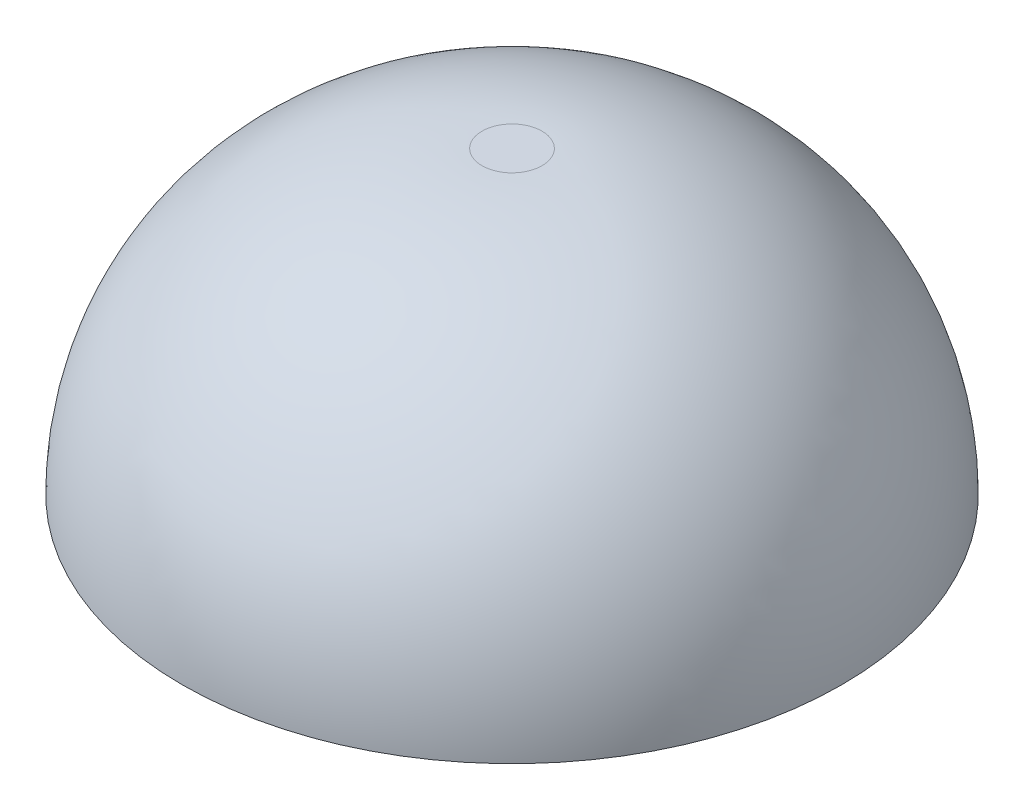
ISO-10303-21;
HEADER;
FILE_DESCRIPTION(('STEP AP214'),'2;1');
FILE_NAME('part.step','',(''),(''),'','','');
FILE_SCHEMA(('AUTOMOTIVE_DESIGN { 1 0 10303 214 1 1 1 1 }'));
ENDSEC;
DATA;
#1=APPLICATION_CONTEXT('core data for automotive mechanical design processes');
#2=APPLICATION_PROTOCOL_DEFINITION('international standard','automotive_design',2000,#1);
#3=PRODUCT_CONTEXT('',#1,'mechanical');
#4=PRODUCT('Part','Part','',(#3));
#5=PRODUCT_RELATED_PRODUCT_CATEGORY('part','',(#4));
#6=PRODUCT_DEFINITION_FORMATION('','',#4);
#7=PRODUCT_DEFINITION_CONTEXT('part definition',#1,'design');
#8=PRODUCT_DEFINITION('design','',#6,#7);
#9=PRODUCT_DEFINITION_SHAPE('','',#8);
#10=(LENGTH_UNIT() NAMED_UNIT(*) SI_UNIT(.MILLI.,.METRE.));
#11=(NAMED_UNIT(*) PLANE_ANGLE_UNIT() SI_UNIT($,.RADIAN.));
#12=(NAMED_UNIT(*) SI_UNIT($,.STERADIAN.) SOLID_ANGLE_UNIT());
#13=UNCERTAINTY_MEASURE_WITH_UNIT(LENGTH_MEASURE(1.E-05),#10,'distance_accuracy_value','');
#14=(GEOMETRIC_REPRESENTATION_CONTEXT(3) GLOBAL_UNCERTAINTY_ASSIGNED_CONTEXT((#13)) GLOBAL_UNIT_ASSIGNED_CONTEXT((#10,
#11,#12)) REPRESENTATION_CONTEXT('',''));
#15=CARTESIAN_POINT('',(0.,0.,0.));
#16=DIRECTION('',(0.,0.,1.));
#17=DIRECTION('',(1.,0.,0.));
#18=AXIS2_PLACEMENT_3D('',#15,#16,#17);
#19=CARTESIAN_POINT('',(0.,0.,0.));
#20=DIRECTION('',(0.,-1.,0.));
#21=DIRECTION('',(0.,0.,-1.));
#22=AXIS2_PLACEMENT_3D('',#19,#20,#21);
#23=DEGENERATE_TOROIDAL_SURFACE('',#22,0.508,5.08,.T.);
#24=CARTESIAN_POINT('',(0.,5.08,0.));
#25=DIRECTION('',(0.,-1.,0.));
#26=DIRECTION('',(0.,0.,-1.));
#27=AXIS2_PLACEMENT_3D('',#24,#25,#26);
#28=CIRCLE('',#27,0.507999999999999);
#29=CARTESIAN_POINT('',(0.,5.08,-0.507999999999999));
#30=VERTEX_POINT('',#29);
#31=EDGE_CURVE('E10',#30,#30,#28,.T.);
#32=ORIENTED_EDGE('',*,*,#31,.T.);
#33=EDGE_LOOP('',(#32));
#34=FACE_BOUND('',#33,.T.);
#35=CARTESIAN_POINT('',(0.,0.,0.));
#36=DIRECTION('',(0.,-1.,0.));
#37=DIRECTION('',(0.,0.,-1.));
#38=AXIS2_PLACEMENT_3D('',#35,#36,#37);
#39=CIRCLE('',#38,5.588);
#40=CARTESIAN_POINT('',(0.,0.,-5.588));
#41=VERTEX_POINT('',#40);
#42=EDGE_CURVE('E36',#41,#41,#39,.T.);
#43=ORIENTED_EDGE('',*,*,#42,.F.);
#44=EDGE_LOOP('',(#43));
#45=FACE_BOUND('',#44,.T.);
#46=ADVANCED_FACE('F30',(#34,#45),#23,.T.);
#47=CARTESIAN_POINT('',(0.,5.08,-0.507999999999999));
#48=DIRECTION('',(0.,1.,0.));
#49=DIRECTION('',(0.,0.,1.));
#50=AXIS2_PLACEMENT_3D('',#47,#48,#49);
#51=PLANE('',#50);
#52=ORIENTED_EDGE('',*,*,#31,.F.);
#53=EDGE_LOOP('',(#52));
#54=FACE_BOUND('',#53,.T.);
#55=ADVANCED_FACE('F45',(#54),#51,.T.);
#56=CARTESIAN_POINT('',(0.,0.,0.));
#57=DIRECTION('',(0.,-1.,0.));
#58=DIRECTION('',(0.,0.,-1.));
#59=AXIS2_PLACEMENT_3D('',#56,#57,#58);
#60=PLANE('',#59);
#61=ORIENTED_EDGE('',*,*,#42,.T.);
#62=EDGE_LOOP('',(#61));
#63=FACE_BOUND('',#62,.T.);
#64=ADVANCED_FACE('F42',(#63),#60,.T.);
#65=CLOSED_SHELL('',(#46,#55,#64));
#66=MANIFOLD_SOLID_BREP('B2',#65);
#67=ADVANCED_BREP_SHAPE_REPRESENTATION('',(#18,#66),#14);
#68=SHAPE_DEFINITION_REPRESENTATION(#9,#67);
ENDSEC;
END-ISO-10303-21;
